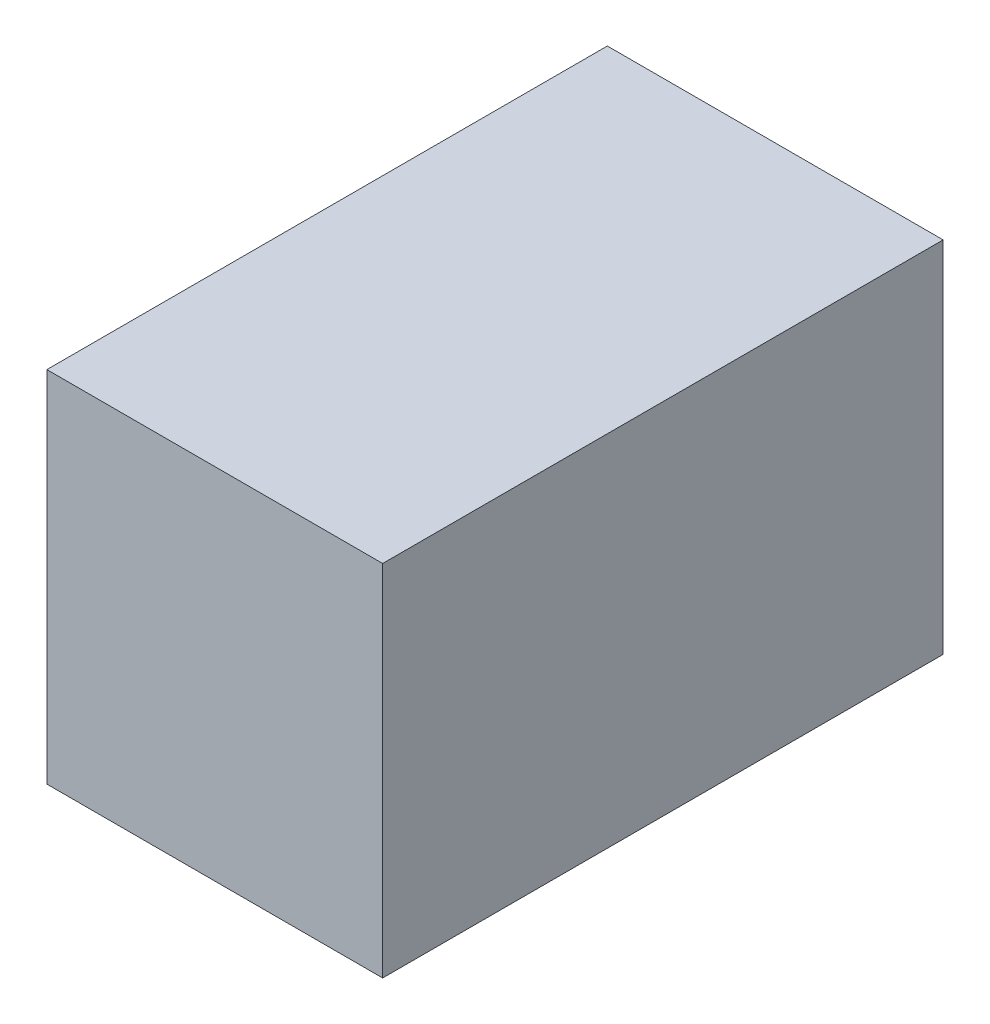
ISO-10303-21;
HEADER;
FILE_DESCRIPTION(('STEP AP214'),'2;1');
FILE_NAME('part.step','',(''),(''),'','','');
FILE_SCHEMA(('AUTOMOTIVE_DESIGN { 1 0 10303 214 1 1 1 1 }'));
ENDSEC;
DATA;
#1=APPLICATION_CONTEXT('core data for automotive mechanical design processes');
#2=APPLICATION_PROTOCOL_DEFINITION('international standard','automotive_design',2000,#1);
#3=PRODUCT_CONTEXT('',#1,'mechanical');
#4=PRODUCT('Part','Part','',(#3));
#5=PRODUCT_RELATED_PRODUCT_CATEGORY('part','',(#4));
#6=PRODUCT_DEFINITION_FORMATION('','',#4);
#7=PRODUCT_DEFINITION_CONTEXT('part definition',#1,'design');
#8=PRODUCT_DEFINITION('design','',#6,#7);
#9=PRODUCT_DEFINITION_SHAPE('','',#8);
#10=(LENGTH_UNIT() NAMED_UNIT(*) SI_UNIT(.MILLI.,.METRE.));
#11=(NAMED_UNIT(*) PLANE_ANGLE_UNIT() SI_UNIT($,.RADIAN.));
#12=(NAMED_UNIT(*) SI_UNIT($,.STERADIAN.) SOLID_ANGLE_UNIT());
#13=UNCERTAINTY_MEASURE_WITH_UNIT(LENGTH_MEASURE(1.E-05),#10,'distance_accuracy_value','');
#14=(GEOMETRIC_REPRESENTATION_CONTEXT(3) GLOBAL_UNCERTAINTY_ASSIGNED_CONTEXT((#13)) GLOBAL_UNIT_ASSIGNED_CONTEXT((#10,
#11,#12)) REPRESENTATION_CONTEXT('',''));
#15=CARTESIAN_POINT('',(0.,0.,0.));
#16=DIRECTION('',(0.,0.,1.));
#17=DIRECTION('',(1.,0.,0.));
#18=AXIS2_PLACEMENT_3D('',#15,#16,#17);
#19=CARTESIAN_POINT('',(19.,9.225,-17.525));
#20=DIRECTION('',(0.,0.,1.));
#21=DIRECTION('',(1.,0.,0.));
#22=AXIS2_PLACEMENT_3D('',#19,#20,#21);
#23=PLANE('',#22);
#24=DIRECTION('',(0.,-1.,0.));
#25=VECTOR('',#24,1.);
#26=CARTESIAN_POINT('',(12.,9.22499999999999,-17.525));
#27=LINE('',#26,#25);
#28=CARTESIAN_POINT('',(12.,9.22499999999999,-17.525));
#29=VERTEX_POINT('',#28);
#30=CARTESIAN_POINT('',(12.,-9.225,-17.525));
#31=VERTEX_POINT('',#30);
#32=EDGE_CURVE('E202',#29,#31,#27,.T.);
#33=ORIENTED_EDGE('',*,*,#32,.F.);
#34=DIRECTION('',(1.,0.,0.));
#35=VECTOR('',#34,1.);
#36=CARTESIAN_POINT('',(0.,9.225,-17.525));
#37=LINE('',#36,#35);
#38=CARTESIAN_POINT('',(0.,9.225,-17.525));
#39=VERTEX_POINT('',#38);
#40=EDGE_CURVE('E206',#39,#29,#37,.T.);
#41=ORIENTED_EDGE('',*,*,#40,.F.);
#42=DIRECTION('',(0.,1.,0.));
#43=VECTOR('',#42,1.);
#44=CARTESIAN_POINT('',(0.,9.225,-17.525));
#45=LINE('',#44,#43);
#46=CARTESIAN_POINT('',(0.,11.225,-17.525));
#47=VERTEX_POINT('',#46);
#48=EDGE_CURVE('E92',#39,#47,#45,.T.);
#49=ORIENTED_EDGE('',*,*,#48,.T.);
#50=DIRECTION('',(-1.,0.,0.));
#51=VECTOR('',#50,1.);
#52=CARTESIAN_POINT('',(19.,11.225,-17.525));
#53=LINE('',#52,#51);
#54=CARTESIAN_POINT('',(21.,11.225,-17.525));
#55=VERTEX_POINT('',#54);
#56=EDGE_CURVE('E11',#55,#47,#53,.T.);
#57=ORIENTED_EDGE('',*,*,#56,.F.);
#58=DIRECTION('',(0.,1.,0.));
#59=VECTOR('',#58,1.);
#60=CARTESIAN_POINT('',(21.,9.225,-17.525));
#61=LINE('',#60,#59);
#62=CARTESIAN_POINT('',(21.,-11.225,-17.525));
#63=VERTEX_POINT('',#62);
#64=EDGE_CURVE('E120',#63,#55,#61,.T.);
#65=ORIENTED_EDGE('',*,*,#64,.F.);
#66=DIRECTION('',(-1.,0.,0.));
#67=VECTOR('',#66,1.);
#68=CARTESIAN_POINT('',(19.,-11.225,-17.525));
#69=LINE('',#68,#67);
#70=CARTESIAN_POINT('',(0.,-11.225,-17.525));
#71=VERTEX_POINT('',#70);
#72=EDGE_CURVE('E136',#63,#71,#69,.T.);
#73=ORIENTED_EDGE('',*,*,#72,.T.);
#74=CARTESIAN_POINT('',(0.,-9.225,-17.525));
#75=VERTEX_POINT('',#74);
#76=EDGE_CURVE('E140',#71,#75,#45,.T.);
#77=ORIENTED_EDGE('',*,*,#76,.T.);
#78=DIRECTION('',(-1.,0.,0.));
#79=VECTOR('',#78,1.);
#80=CARTESIAN_POINT('',(12.,-9.225,-17.525));
#81=LINE('',#80,#79);
#82=EDGE_CURVE('E198',#31,#75,#81,.T.);
#83=ORIENTED_EDGE('',*,*,#82,.F.);
#84=EDGE_LOOP('',(#33,#41,#49,#57,#65,#73,#77,#83));
#85=FACE_BOUND('',#84,.T.);
#86=ADVANCED_FACE('F43',(#85),#23,.F.);
#87=CARTESIAN_POINT('',(19.,11.225,15.525));
#88=DIRECTION('',(0.,-1.,0.));
#89=DIRECTION('',(0.,0.,-1.));
#90=AXIS2_PLACEMENT_3D('',#87,#88,#89);
#91=PLANE('',#90);
#92=DIRECTION('',(0.,0.,1.));
#93=VECTOR('',#92,1.);
#94=CARTESIAN_POINT('',(0.,11.225,15.525));
#95=LINE('',#94,#93);
#96=CARTESIAN_POINT('',(0.,11.225,17.525));
#97=VERTEX_POINT('',#96);
#98=EDGE_CURVE('E47',#47,#97,#95,.T.);
#99=ORIENTED_EDGE('',*,*,#98,.T.);
#100=DIRECTION('',(-1.,0.,0.));
#101=VECTOR('',#100,1.);
#102=CARTESIAN_POINT('',(19.,11.225,17.525));
#103=LINE('',#102,#101);
#104=CARTESIAN_POINT('',(21.,11.225,17.525));
#105=VERTEX_POINT('',#104);
#106=EDGE_CURVE('E53',#105,#97,#103,.T.);
#107=ORIENTED_EDGE('',*,*,#106,.F.);
#108=DIRECTION('',(0.,0.,1.));
#109=VECTOR('',#108,1.);
#110=CARTESIAN_POINT('',(21.,11.225,15.525));
#111=LINE('',#110,#109);
#112=EDGE_CURVE('E114',#55,#105,#111,.T.);
#113=ORIENTED_EDGE('',*,*,#112,.F.);
#114=ORIENTED_EDGE('',*,*,#56,.T.);
#115=EDGE_LOOP('',(#99,#107,#113,#114));
#116=FACE_BOUND('',#115,.T.);
#117=ADVANCED_FACE('F125',(#116),#91,.F.);
#118=CARTESIAN_POINT('',(19.,9.225,17.525));
#119=DIRECTION('',(0.,0.,-1.));
#120=DIRECTION('',(0.,1.,0.));
#121=AXIS2_PLACEMENT_3D('',#118,#119,#120);
#122=PLANE('',#121);
#123=DIRECTION('',(0.,-1.,0.));
#124=VECTOR('',#123,1.);
#125=CARTESIAN_POINT('',(0.,9.225,17.525));
#126=LINE('',#125,#124);
#127=CARTESIAN_POINT('',(0.,-11.225,17.525));
#128=VERTEX_POINT('',#127);
#129=EDGE_CURVE('E146',#97,#128,#126,.T.);
#130=ORIENTED_EDGE('',*,*,#129,.T.);
#131=DIRECTION('',(-1.,0.,0.));
#132=VECTOR('',#131,1.);
#133=CARTESIAN_POINT('',(19.,-11.225,17.525));
#134=LINE('',#133,#132);
#135=CARTESIAN_POINT('',(21.,-11.225,17.525));
#136=VERTEX_POINT('',#135);
#137=EDGE_CURVE('E129',#136,#128,#134,.T.);
#138=ORIENTED_EDGE('',*,*,#137,.F.);
#139=DIRECTION('',(0.,-1.,0.));
#140=VECTOR('',#139,1.);
#141=CARTESIAN_POINT('',(21.,9.225,17.525));
#142=LINE('',#141,#140);
#143=EDGE_CURVE('E117',#105,#136,#142,.T.);
#144=ORIENTED_EDGE('',*,*,#143,.F.);
#145=ORIENTED_EDGE('',*,*,#106,.T.);
#146=EDGE_LOOP('',(#130,#138,#144,#145));
#147=FACE_BOUND('',#146,.T.);
#148=ADVANCED_FACE('F131',(#147),#122,.F.);
#149=CARTESIAN_POINT('',(19.,-11.225,15.525));
#150=DIRECTION('',(0.,1.,0.));
#151=DIRECTION('',(0.,0.,1.));
#152=AXIS2_PLACEMENT_3D('',#149,#150,#151);
#153=PLANE('',#152);
#154=DIRECTION('',(0.,0.,-1.));
#155=VECTOR('',#154,1.);
#156=CARTESIAN_POINT('',(0.,-11.225,15.525));
#157=LINE('',#156,#155);
#158=EDGE_CURVE('E144',#128,#71,#157,.T.);
#159=ORIENTED_EDGE('',*,*,#158,.T.);
#160=ORIENTED_EDGE('',*,*,#72,.F.);
#161=DIRECTION('',(0.,0.,-1.));
#162=VECTOR('',#161,1.);
#163=CARTESIAN_POINT('',(21.,-11.225,15.525));
#164=LINE('',#163,#162);
#165=EDGE_CURVE('E70',#136,#63,#164,.T.);
#166=ORIENTED_EDGE('',*,*,#165,.F.);
#167=ORIENTED_EDGE('',*,*,#137,.T.);
#168=EDGE_LOOP('',(#159,#160,#166,#167));
#169=FACE_BOUND('',#168,.T.);
#170=ADVANCED_FACE('F224',(#169),#153,.F.);
#171=CARTESIAN_POINT('',(21.,0.,0.));
#172=DIRECTION('',(1.,0.,0.));
#173=DIRECTION('',(0.,0.,-1.));
#174=AXIS2_PLACEMENT_3D('',#171,#172,#173);
#175=PLANE('',#174);
#176=ORIENTED_EDGE('',*,*,#64,.T.);
#177=ORIENTED_EDGE('',*,*,#112,.T.);
#178=ORIENTED_EDGE('',*,*,#143,.T.);
#179=ORIENTED_EDGE('',*,*,#165,.T.);
#180=EDGE_LOOP('',(#176,#177,#178,#179));
#181=FACE_BOUND('',#180,.T.);
#182=ADVANCED_FACE('F45',(#181),#175,.T.);
#183=CARTESIAN_POINT('',(0.,0.,0.));
#184=DIRECTION('',(1.,0.,0.));
#185=DIRECTION('',(0.,0.,-1.));
#186=AXIS2_PLACEMENT_3D('',#183,#184,#185);
#187=PLANE('',#186);
#188=ORIENTED_EDGE('',*,*,#48,.F.);
#189=DIRECTION('',(0.,0.,1.));
#190=VECTOR('',#189,1.);
#191=CARTESIAN_POINT('',(0.,9.225,15.525));
#192=LINE('',#191,#190);
#193=CARTESIAN_POINT('',(0.,9.225,15.525));
#194=VERTEX_POINT('',#193);
#195=EDGE_CURVE('E182',#39,#194,#192,.T.);
#196=ORIENTED_EDGE('',*,*,#195,.T.);
#197=DIRECTION('',(0.,-1.,0.));
#198=VECTOR('',#197,1.);
#199=CARTESIAN_POINT('',(0.,9.225,15.525));
#200=LINE('',#199,#198);
#201=CARTESIAN_POINT('',(0.,-9.225,15.525));
#202=VERTEX_POINT('',#201);
#203=EDGE_CURVE('E61',#194,#202,#200,.T.);
#204=ORIENTED_EDGE('',*,*,#203,.T.);
#205=DIRECTION('',(0.,0.,-1.));
#206=VECTOR('',#205,1.);
#207=CARTESIAN_POINT('',(0.,-9.225,15.525));
#208=LINE('',#207,#206);
#209=EDGE_CURVE('E176',#202,#75,#208,.T.);
#210=ORIENTED_EDGE('',*,*,#209,.T.);
#211=ORIENTED_EDGE('',*,*,#76,.F.);
#212=ORIENTED_EDGE('',*,*,#158,.F.);
#213=ORIENTED_EDGE('',*,*,#129,.F.);
#214=ORIENTED_EDGE('',*,*,#98,.F.);
#215=EDGE_LOOP('',(#188,#196,#204,#210,#211,#212,#213,#214));
#216=FACE_BOUND('',#215,.T.);
#217=ADVANCED_FACE('F226',(#216),#187,.F.);
#218=CARTESIAN_POINT('',(19.,9.225,-15.525));
#219=DIRECTION('',(0.,0.,1.));
#220=DIRECTION('',(1.,0.,0.));
#221=AXIS2_PLACEMENT_3D('',#218,#219,#220);
#222=PLANE('',#221);
#223=DIRECTION('',(0.,-1.,0.));
#224=VECTOR('',#223,1.);
#225=CARTESIAN_POINT('',(12.,9.22499999999999,-15.525));
#226=LINE('',#225,#224);
#227=CARTESIAN_POINT('',(12.,9.22499999999999,-15.525));
#228=VERTEX_POINT('',#227);
#229=CARTESIAN_POINT('',(12.,-9.225,-15.525));
#230=VERTEX_POINT('',#229);
#231=EDGE_CURVE('E190',#228,#230,#226,.T.);
#232=ORIENTED_EDGE('',*,*,#231,.T.);
#233=DIRECTION('',(-1.,0.,0.));
#234=VECTOR('',#233,1.);
#235=CARTESIAN_POINT('',(19.,-9.225,-15.525));
#236=LINE('',#235,#234);
#237=CARTESIAN_POINT('',(19.,-9.225,-15.525));
#238=VERTEX_POINT('',#237);
#239=EDGE_CURVE('E160',#238,#230,#236,.T.);
#240=ORIENTED_EDGE('',*,*,#239,.F.);
#241=DIRECTION('',(0.,1.,0.));
#242=VECTOR('',#241,1.);
#243=CARTESIAN_POINT('',(19.,9.225,-15.525));
#244=LINE('',#243,#242);
#245=CARTESIAN_POINT('',(19.,9.225,-15.525));
#246=VERTEX_POINT('',#245);
#247=EDGE_CURVE('E172',#238,#246,#244,.T.);
#248=ORIENTED_EDGE('',*,*,#247,.T.);
#249=DIRECTION('',(-1.,0.,0.));
#250=VECTOR('',#249,1.);
#251=CARTESIAN_POINT('',(19.,9.225,-15.525));
#252=LINE('',#251,#250);
#253=EDGE_CURVE('E151',#246,#228,#252,.T.);
#254=ORIENTED_EDGE('',*,*,#253,.T.);
#255=EDGE_LOOP('',(#232,#240,#248,#254));
#256=FACE_BOUND('',#255,.T.);
#257=ADVANCED_FACE('F250',(#256),#222,.T.);
#258=CARTESIAN_POINT('',(19.,9.225,15.525));
#259=DIRECTION('',(0.,-1.,0.));
#260=DIRECTION('',(0.,0.,-1.));
#261=AXIS2_PLACEMENT_3D('',#258,#259,#260);
#262=PLANE('',#261);
#263=ORIENTED_EDGE('',*,*,#195,.F.);
#264=ORIENTED_EDGE('',*,*,#40,.T.);
#265=DIRECTION('',(0.,0.,-1.));
#266=VECTOR('',#265,1.);
#267=CARTESIAN_POINT('',(12.,9.22499999999999,6.48414582622416));
#268=LINE('',#267,#266);
#269=EDGE_CURVE('E194',#228,#29,#268,.T.);
#270=ORIENTED_EDGE('',*,*,#269,.F.);
#271=ORIENTED_EDGE('',*,*,#253,.F.);
#272=DIRECTION('',(0.,0.,1.));
#273=VECTOR('',#272,1.);
#274=CARTESIAN_POINT('',(19.,9.225,15.525));
#275=LINE('',#274,#273);
#276=CARTESIAN_POINT('',(19.,9.225,15.525));
#277=VERTEX_POINT('',#276);
#278=EDGE_CURVE('E168',#246,#277,#275,.T.);
#279=ORIENTED_EDGE('',*,*,#278,.T.);
#280=DIRECTION('',(-1.,0.,0.));
#281=VECTOR('',#280,1.);
#282=CARTESIAN_POINT('',(19.,9.225,15.525));
#283=LINE('',#282,#281);
#284=EDGE_CURVE('E154',#277,#194,#283,.T.);
#285=ORIENTED_EDGE('',*,*,#284,.T.);
#286=EDGE_LOOP('',(#263,#264,#270,#271,#279,#285));
#287=FACE_BOUND('',#286,.T.);
#288=ADVANCED_FACE('F243',(#287),#262,.T.);
#289=CARTESIAN_POINT('',(19.,9.225,15.525));
#290=DIRECTION('',(0.,0.,-1.));
#291=DIRECTION('',(0.,1.,0.));
#292=AXIS2_PLACEMENT_3D('',#289,#290,#291);
#293=PLANE('',#292);
#294=ORIENTED_EDGE('',*,*,#203,.F.);
#295=ORIENTED_EDGE('',*,*,#284,.F.);
#296=DIRECTION('',(0.,-1.,0.));
#297=VECTOR('',#296,1.);
#298=CARTESIAN_POINT('',(19.,9.225,15.525));
#299=LINE('',#298,#297);
#300=CARTESIAN_POINT('',(19.,-9.225,15.525));
#301=VERTEX_POINT('',#300);
#302=EDGE_CURVE('E165',#277,#301,#299,.T.);
#303=ORIENTED_EDGE('',*,*,#302,.T.);
#304=DIRECTION('',(-1.,0.,0.));
#305=VECTOR('',#304,1.);
#306=CARTESIAN_POINT('',(19.,-9.225,15.525));
#307=LINE('',#306,#305);
#308=EDGE_CURVE('E157',#301,#202,#307,.T.);
#309=ORIENTED_EDGE('',*,*,#308,.T.);
#310=EDGE_LOOP('',(#294,#295,#303,#309));
#311=FACE_BOUND('',#310,.T.);
#312=ADVANCED_FACE('F247',(#311),#293,.T.);
#313=CARTESIAN_POINT('',(19.,-9.225,15.525));
#314=DIRECTION('',(0.,1.,0.));
#315=DIRECTION('',(0.,0.,1.));
#316=AXIS2_PLACEMENT_3D('',#313,#314,#315);
#317=PLANE('',#316);
#318=ORIENTED_EDGE('',*,*,#209,.F.);
#319=ORIENTED_EDGE('',*,*,#308,.F.);
#320=DIRECTION('',(0.,0.,-1.));
#321=VECTOR('',#320,1.);
#322=CARTESIAN_POINT('',(19.,-9.225,15.525));
#323=LINE('',#322,#321);
#324=EDGE_CURVE('E101',#301,#238,#323,.T.);
#325=ORIENTED_EDGE('',*,*,#324,.T.);
#326=ORIENTED_EDGE('',*,*,#239,.T.);
#327=DIRECTION('',(0.,0.,-1.));
#328=VECTOR('',#327,1.);
#329=CARTESIAN_POINT('',(12.,-9.225,6.48414582622416));
#330=LINE('',#329,#328);
#331=EDGE_CURVE('E186',#230,#31,#330,.T.);
#332=ORIENTED_EDGE('',*,*,#331,.T.);
#333=ORIENTED_EDGE('',*,*,#82,.T.);
#334=EDGE_LOOP('',(#318,#319,#325,#326,#332,#333));
#335=FACE_BOUND('',#334,.T.);
#336=ADVANCED_FACE('F252',(#335),#317,.T.);
#337=CARTESIAN_POINT('',(19.,0.,0.));
#338=DIRECTION('',(1.,0.,0.));
#339=DIRECTION('',(0.,0.,-1.));
#340=AXIS2_PLACEMENT_3D('',#337,#338,#339);
#341=PLANE('',#340);
#342=ORIENTED_EDGE('',*,*,#247,.F.);
#343=ORIENTED_EDGE('',*,*,#324,.F.);
#344=ORIENTED_EDGE('',*,*,#302,.F.);
#345=ORIENTED_EDGE('',*,*,#278,.F.);
#346=EDGE_LOOP('',(#342,#343,#344,#345));
#347=FACE_BOUND('',#346,.T.);
#348=ADVANCED_FACE('F248',(#347),#341,.F.);
#349=CARTESIAN_POINT('',(12.,9.22499999999999,6.48414582622416));
#350=DIRECTION('',(1.,0.,0.));
#351=DIRECTION('',(0.,1.,0.));
#352=AXIS2_PLACEMENT_3D('',#349,#350,#351);
#353=PLANE('',#352);
#354=ORIENTED_EDGE('',*,*,#269,.T.);
#355=ORIENTED_EDGE('',*,*,#32,.T.);
#356=ORIENTED_EDGE('',*,*,#331,.F.);
#357=ORIENTED_EDGE('',*,*,#231,.F.);
#358=EDGE_LOOP('',(#354,#355,#356,#357));
#359=FACE_BOUND('',#358,.T.);
#360=ADVANCED_FACE('F254',(#359),#353,.F.);
#361=CLOSED_SHELL('',(#86,#117,#148,#170,#182,#217,#257,#288,#312,#336,#348,#360));
#362=MANIFOLD_SOLID_BREP('B2',#361);
#363=ADVANCED_BREP_SHAPE_REPRESENTATION('',(#18,#362),#14);
#364=SHAPE_DEFINITION_REPRESENTATION(#9,#363);
ENDSEC;
END-ISO-10303-21;
